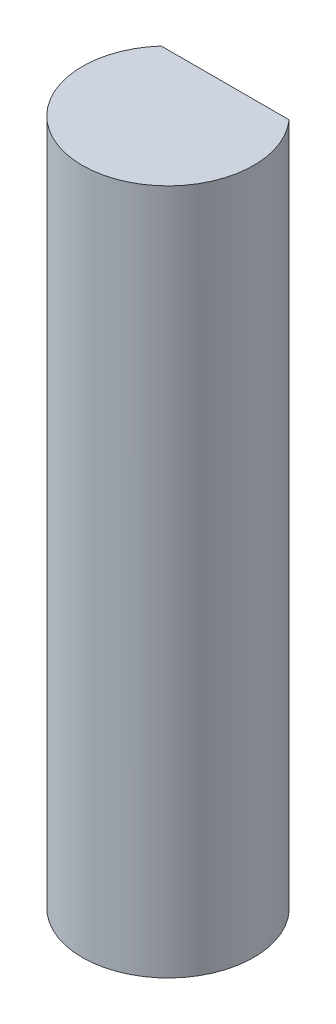
ISO-10303-21;
HEADER;
FILE_DESCRIPTION(('STEP AP214'),'2;1');
FILE_NAME('part.step','',(''),(''),'','','');
FILE_SCHEMA(('AUTOMOTIVE_DESIGN { 1 0 10303 214 1 1 1 1 }'));
ENDSEC;
DATA;
#1=APPLICATION_CONTEXT('core data for automotive mechanical design processes');
#2=APPLICATION_PROTOCOL_DEFINITION('international standard','automotive_design',2000,#1);
#3=PRODUCT_CONTEXT('',#1,'mechanical');
#4=PRODUCT('Part','Part','',(#3));
#5=PRODUCT_RELATED_PRODUCT_CATEGORY('part','',(#4));
#6=PRODUCT_DEFINITION_FORMATION('','',#4);
#7=PRODUCT_DEFINITION_CONTEXT('part definition',#1,'design');
#8=PRODUCT_DEFINITION('design','',#6,#7);
#9=PRODUCT_DEFINITION_SHAPE('','',#8);
#10=(LENGTH_UNIT() NAMED_UNIT(*) SI_UNIT(.MILLI.,.METRE.));
#11=(NAMED_UNIT(*) PLANE_ANGLE_UNIT() SI_UNIT($,.RADIAN.));
#12=(NAMED_UNIT(*) SI_UNIT($,.STERADIAN.) SOLID_ANGLE_UNIT());
#13=UNCERTAINTY_MEASURE_WITH_UNIT(LENGTH_MEASURE(1.E-05),#10,'distance_accuracy_value','');
#14=(GEOMETRIC_REPRESENTATION_CONTEXT(3) GLOBAL_UNCERTAINTY_ASSIGNED_CONTEXT((#13)) GLOBAL_UNIT_ASSIGNED_CONTEXT((#10,
#11,#12)) REPRESENTATION_CONTEXT('',''));
#15=CARTESIAN_POINT('',(0.,0.,0.));
#16=DIRECTION('',(0.,0.,1.));
#17=DIRECTION('',(1.,0.,0.));
#18=AXIS2_PLACEMENT_3D('',#15,#16,#17);
#19=CARTESIAN_POINT('',(0.,10.,0.));
#20=DIRECTION('',(0.,-1.,0.));
#21=DIRECTION('',(0.,0.,-1.));
#22=AXIS2_PLACEMENT_3D('',#19,#20,#21);
#23=CYLINDRICAL_SURFACE('',#22,1.5);
#24=CARTESIAN_POINT('',(0.,10.,0.));
#25=DIRECTION('',(0.,1.,0.));
#26=DIRECTION('',(0.,0.,1.));
#27=AXIS2_PLACEMENT_3D('',#24,#25,#26);
#28=CIRCLE('',#27,1.5);
#29=CARTESIAN_POINT('',(-1.1180339887499,10.,-1.));
#30=VERTEX_POINT('',#29);
#31=CARTESIAN_POINT('',(1.1180339887499,10.,-1.));
#32=VERTEX_POINT('',#31);
#33=EDGE_CURVE('E11',#30,#32,#28,.T.);
#34=ORIENTED_EDGE('',*,*,#33,.F.);
#35=DIRECTION('',(0.,1.,0.));
#36=VECTOR('',#35,1.);
#37=CARTESIAN_POINT('',(-1.1180339887499,0.,-1.));
#38=LINE('',#37,#36);
#39=CARTESIAN_POINT('',(-1.1180339887499,0.,-1.));
#40=VERTEX_POINT('',#39);
#41=EDGE_CURVE('E58',#40,#30,#38,.T.);
#42=ORIENTED_EDGE('',*,*,#41,.F.);
#43=CARTESIAN_POINT('',(0.,0.,0.));
#44=DIRECTION('',(0.,-1.,0.));
#45=DIRECTION('',(0.,0.,-1.));
#46=AXIS2_PLACEMENT_3D('',#43,#44,#45);
#47=CIRCLE('',#46,1.5);
#48=CARTESIAN_POINT('',(1.1180339887499,0.,-1.));
#49=VERTEX_POINT('',#48);
#50=EDGE_CURVE('E70',#40,#49,#47,.T.);
#51=ORIENTED_EDGE('',*,*,#50,.T.);
#52=DIRECTION('',(0.,1.,0.));
#53=VECTOR('',#52,1.);
#54=CARTESIAN_POINT('',(1.1180339887499,0.,-1.));
#55=LINE('',#54,#53);
#56=EDGE_CURVE('E44',#49,#32,#55,.T.);
#57=ORIENTED_EDGE('',*,*,#56,.T.);
#58=EDGE_LOOP('',(#34,#42,#51,#57));
#59=FACE_BOUND('',#58,.T.);
#60=CARTESIAN_POINT('',(0.,-2.,0.));
#61=DIRECTION('',(0.,-1.,0.));
#62=DIRECTION('',(0.,0.,-1.));
#63=AXIS2_PLACEMENT_3D('',#60,#61,#62);
#64=CIRCLE('',#63,1.5);
#65=CARTESIAN_POINT('',(0.,-2.,-1.5));
#66=VERTEX_POINT('',#65);
#67=EDGE_CURVE('E73',#66,#66,#64,.T.);
#68=ORIENTED_EDGE('',*,*,#67,.F.);
#69=EDGE_LOOP('',(#68));
#70=FACE_BOUND('',#69,.T.);
#71=ADVANCED_FACE('F35',(#59,#70),#23,.T.);
#72=CARTESIAN_POINT('',(0.,10.,0.));
#73=DIRECTION('',(0.,1.,0.));
#74=DIRECTION('',(0.,0.,1.));
#75=AXIS2_PLACEMENT_3D('',#72,#73,#74);
#76=PLANE('',#75);
#77=DIRECTION('',(1.,0.,0.));
#78=VECTOR('',#77,1.);
#79=CARTESIAN_POINT('',(-1.1180339887499,10.,-1.));
#80=LINE('',#79,#78);
#81=EDGE_CURVE('E62',#30,#32,#80,.T.);
#82=ORIENTED_EDGE('',*,*,#81,.F.);
#83=ORIENTED_EDGE('',*,*,#33,.T.);
#84=EDGE_LOOP('',(#82,#83));
#85=FACE_BOUND('',#84,.T.);
#86=ADVANCED_FACE('F88',(#85),#76,.T.);
#87=CARTESIAN_POINT('',(-1.1180339887499,0.,-1.));
#88=DIRECTION('',(0.,0.,1.));
#89=DIRECTION('',(1.,0.,0.));
#90=AXIS2_PLACEMENT_3D('',#87,#88,#89);
#91=PLANE('',#90);
#92=ORIENTED_EDGE('',*,*,#81,.T.);
#93=ORIENTED_EDGE('',*,*,#56,.F.);
#94=DIRECTION('',(1.,0.,0.));
#95=VECTOR('',#94,1.);
#96=CARTESIAN_POINT('',(-1.1180339887499,0.,-1.));
#97=LINE('',#96,#95);
#98=EDGE_CURVE('E52',#40,#49,#97,.T.);
#99=ORIENTED_EDGE('',*,*,#98,.F.);
#100=ORIENTED_EDGE('',*,*,#41,.T.);
#101=EDGE_LOOP('',(#92,#93,#99,#100));
#102=FACE_BOUND('',#101,.T.);
#103=ADVANCED_FACE('F61',(#102),#91,.F.);
#104=CARTESIAN_POINT('',(0.,0.,0.));
#105=DIRECTION('',(0.,-1.,0.));
#106=DIRECTION('',(0.,0.,-1.));
#107=AXIS2_PLACEMENT_3D('',#104,#105,#106);
#108=PLANE('',#107);
#109=ORIENTED_EDGE('',*,*,#50,.F.);
#110=ORIENTED_EDGE('',*,*,#98,.T.);
#111=EDGE_LOOP('',(#109,#110));
#112=FACE_BOUND('',#111,.T.);
#113=ADVANCED_FACE('F69',(#112),#108,.F.);
#114=CARTESIAN_POINT('',(0.,-2.,0.));
#115=DIRECTION('',(0.,-1.,0.));
#116=DIRECTION('',(0.,0.,-1.));
#117=AXIS2_PLACEMENT_3D('',#114,#115,#116);
#118=PLANE('',#117);
#119=ORIENTED_EDGE('',*,*,#67,.T.);
#120=EDGE_LOOP('',(#119));
#121=FACE_BOUND('',#120,.T.);
#122=ADVANCED_FACE('F86',(#121),#118,.T.);
#123=CLOSED_SHELL('',(#71,#86,#103,#113,#122));
#124=MANIFOLD_SOLID_BREP('B2',#123);
#125=ADVANCED_BREP_SHAPE_REPRESENTATION('',(#18,#124),#14);
#126=SHAPE_DEFINITION_REPRESENTATION(#9,#125);
ENDSEC;
END-ISO-10303-21;
